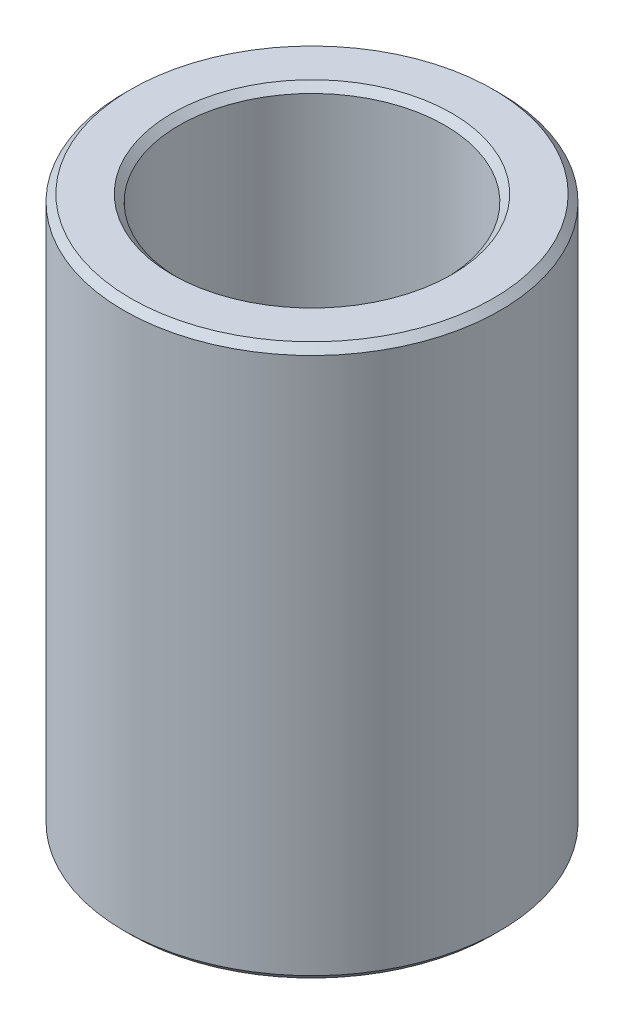
ISO-10303-21;
HEADER;
FILE_DESCRIPTION(('STEP AP214'),'2;1');
FILE_NAME('part.step','',(''),(''),'','','');
FILE_SCHEMA(('AUTOMOTIVE_DESIGN { 1 0 10303 214 1 1 1 1 }'));
ENDSEC;
DATA;
#1=APPLICATION_CONTEXT('core data for automotive mechanical design processes');
#2=APPLICATION_PROTOCOL_DEFINITION('international standard','automotive_design',2000,#1);
#3=PRODUCT_CONTEXT('',#1,'mechanical');
#4=PRODUCT('Part','Part','',(#3));
#5=PRODUCT_RELATED_PRODUCT_CATEGORY('part','',(#4));
#6=PRODUCT_DEFINITION_FORMATION('','',#4);
#7=PRODUCT_DEFINITION_CONTEXT('part definition',#1,'design');
#8=PRODUCT_DEFINITION('design','',#6,#7);
#9=PRODUCT_DEFINITION_SHAPE('','',#8);
#10=(LENGTH_UNIT() NAMED_UNIT(*) SI_UNIT(.MILLI.,.METRE.));
#11=(NAMED_UNIT(*) PLANE_ANGLE_UNIT() SI_UNIT($,.RADIAN.));
#12=(NAMED_UNIT(*) SI_UNIT($,.STERADIAN.) SOLID_ANGLE_UNIT());
#13=UNCERTAINTY_MEASURE_WITH_UNIT(LENGTH_MEASURE(1.E-05),#10,'distance_accuracy_value','');
#14=(GEOMETRIC_REPRESENTATION_CONTEXT(3) GLOBAL_UNCERTAINTY_ASSIGNED_CONTEXT((#13)) GLOBAL_UNIT_ASSIGNED_CONTEXT((#10,
#11,#12)) REPRESENTATION_CONTEXT('',''));
#15=CARTESIAN_POINT('',(0.,0.,0.));
#16=DIRECTION('',(0.,0.,1.));
#17=DIRECTION('',(1.,0.,0.));
#18=AXIS2_PLACEMENT_3D('',#15,#16,#17);
#19=CARTESIAN_POINT('',(0.,139.138711341542,0.));
#20=DIRECTION('',(0.,-1.,0.));
#21=DIRECTION('',(0.,0.,-1.));
#22=AXIS2_PLACEMENT_3D('',#19,#20,#21);
#23=CYLINDRICAL_SURFACE('',#22,47.5);
#24=CARTESIAN_POINT('',(0.,1.75974914424126,0.));
#25=DIRECTION('',(0.,1.,0.));
#26=DIRECTION('',(0.,0.,1.));
#27=AXIS2_PLACEMENT_3D('',#24,#25,#26);
#28=CIRCLE('',#27,47.5);
#29=CARTESIAN_POINT('',(0.,1.75974914424126,47.5));
#30=VERTEX_POINT('',#29);
#31=EDGE_CURVE('E10',#30,#30,#28,.T.);
#32=ORIENTED_EDGE('',*,*,#31,.T.);
#33=EDGE_LOOP('',(#32));
#34=FACE_BOUND('',#33,.T.);
#35=CARTESIAN_POINT('',(0.,137.378962197301,0.));
#36=DIRECTION('',(0.,1.,0.));
#37=DIRECTION('',(0.,0.,1.));
#38=AXIS2_PLACEMENT_3D('',#35,#36,#37);
#39=CIRCLE('',#38,47.5);
#40=CARTESIAN_POINT('',(0.,137.378962197301,47.5));
#41=VERTEX_POINT('',#40);
#42=EDGE_CURVE('E50',#41,#41,#39,.F.);
#43=ORIENTED_EDGE('',*,*,#42,.T.);
#44=EDGE_LOOP('',(#43));
#45=FACE_BOUND('',#44,.T.);
#46=ADVANCED_FACE('F39',(#34,#45),#23,.T.);
#47=CARTESIAN_POINT('',(0.,139.138711341542,0.));
#48=DIRECTION('',(0.,1.,0.));
#49=DIRECTION('',(0.,0.,1.));
#50=AXIS2_PLACEMENT_3D('',#47,#48,#49);
#51=PLANE('',#50);
#52=CARTESIAN_POINT('',(0.,139.138711341542,0.));
#53=DIRECTION('',(0.,1.,0.));
#54=DIRECTION('',(0.,0.,1.));
#55=AXIS2_PLACEMENT_3D('',#52,#53,#54);
#56=CIRCLE('',#55,35.3098455021052);
#57=CARTESIAN_POINT('',(0.,139.138711341542,35.3098455021052));
#58=VERTEX_POINT('',#57);
#59=EDGE_CURVE('E58',#58,#58,#56,.F.);
#60=ORIENTED_EDGE('',*,*,#59,.T.);
#61=EDGE_LOOP('',(#60));
#62=FACE_BOUND('',#61,.T.);
#63=CARTESIAN_POINT('',(0.,139.138711341542,0.));
#64=DIRECTION('',(0.,1.,0.));
#65=DIRECTION('',(0.,0.,1.));
#66=AXIS2_PLACEMENT_3D('',#63,#64,#65);
#67=CIRCLE('',#66,45.7402508557588);
#68=CARTESIAN_POINT('',(0.,139.138711341542,45.7402508557588));
#69=VERTEX_POINT('',#68);
#70=EDGE_CURVE('E61',#69,#69,#67,.T.);
#71=ORIENTED_EDGE('',*,*,#70,.T.);
#72=EDGE_LOOP('',(#71));
#73=FACE_BOUND('',#72,.T.);
#74=ADVANCED_FACE('F88',(#62,#73),#51,.T.);
#75=CARTESIAN_POINT('',(0.,0.,0.));
#76=DIRECTION('',(0.,1.,0.));
#77=DIRECTION('',(0.,0.,1.));
#78=AXIS2_PLACEMENT_3D('',#75,#76,#77);
#79=PLANE('',#78);
#80=CARTESIAN_POINT('',(0.,0.,0.));
#81=DIRECTION('',(0.,1.,0.));
#82=DIRECTION('',(0.,0.,1.));
#83=AXIS2_PLACEMENT_3D('',#80,#81,#82);
#84=CIRCLE('',#83,35.3098455021052);
#85=CARTESIAN_POINT('',(0.,0.,35.3098455021052));
#86=VERTEX_POINT('',#85);
#87=EDGE_CURVE('E51',#86,#86,#84,.T.);
#88=ORIENTED_EDGE('',*,*,#87,.T.);
#89=EDGE_LOOP('',(#88));
#90=FACE_BOUND('',#89,.T.);
#91=CARTESIAN_POINT('',(0.,0.,0.));
#92=DIRECTION('',(0.,1.,0.));
#93=DIRECTION('',(0.,0.,1.));
#94=AXIS2_PLACEMENT_3D('',#91,#92,#93);
#95=CIRCLE('',#94,45.7402508557587);
#96=CARTESIAN_POINT('',(0.,0.,45.7402508557587));
#97=VERTEX_POINT('',#96);
#98=EDGE_CURVE('E54',#97,#97,#95,.F.);
#99=ORIENTED_EDGE('',*,*,#98,.T.);
#100=EDGE_LOOP('',(#99));
#101=FACE_BOUND('',#100,.T.);
#102=ADVANCED_FACE('F83',(#90,#101),#79,.F.);
#103=CARTESIAN_POINT('',(0.,139.138711341542,0.));
#104=DIRECTION('',(0.,-1.,0.));
#105=DIRECTION('',(0.,0.,-1.));
#106=AXIS2_PLACEMENT_3D('',#103,#104,#105);
#107=CYLINDRICAL_SURFACE('',#106,33.5500963578639);
#108=CARTESIAN_POINT('',(0.,137.378962197301,0.));
#109=DIRECTION('',(0.,1.,0.));
#110=DIRECTION('',(0.,0.,1.));
#111=AXIS2_PLACEMENT_3D('',#108,#109,#110);
#112=CIRCLE('',#111,33.5500963578639);
#113=CARTESIAN_POINT('',(0.,137.378962197301,33.5500963578639));
#114=VERTEX_POINT('',#113);
#115=EDGE_CURVE('E67',#114,#114,#112,.T.);
#116=ORIENTED_EDGE('',*,*,#115,.T.);
#117=EDGE_LOOP('',(#116));
#118=FACE_BOUND('',#117,.T.);
#119=CARTESIAN_POINT('',(0.,1.75974914424129,0.));
#120=DIRECTION('',(0.,1.,0.));
#121=DIRECTION('',(0.,0.,1.));
#122=AXIS2_PLACEMENT_3D('',#119,#120,#121);
#123=CIRCLE('',#122,33.5500963578639);
#124=CARTESIAN_POINT('',(0.,1.75974914424129,33.5500963578639));
#125=VERTEX_POINT('',#124);
#126=EDGE_CURVE('E69',#125,#125,#123,.F.);
#127=ORIENTED_EDGE('',*,*,#126,.T.);
#128=EDGE_LOOP('',(#127));
#129=FACE_BOUND('',#128,.T.);
#130=ADVANCED_FACE('F71',(#118,#129),#107,.F.);
#131=CARTESIAN_POINT('',(0.,137.378962197301,0.));
#132=DIRECTION('',(0.,1.,0.));
#133=DIRECTION('',(0.,0.,1.));
#134=AXIS2_PLACEMENT_3D('',#131,#132,#133);
#135=CONICAL_SURFACE('',#134,33.5500963578639,0.785398163397448);
#136=ORIENTED_EDGE('',*,*,#59,.F.);
#137=EDGE_LOOP('',(#136));
#138=FACE_BOUND('',#137,.T.);
#139=ORIENTED_EDGE('',*,*,#115,.F.);
#140=EDGE_LOOP('',(#139));
#141=FACE_BOUND('',#140,.T.);
#142=ADVANCED_FACE('F77',(#138,#141),#135,.F.);
#143=CARTESIAN_POINT('',(0.,0.,0.));
#144=DIRECTION('',(0.,-1.,0.));
#145=DIRECTION('',(0.,0.,-1.));
#146=AXIS2_PLACEMENT_3D('',#143,#144,#145);
#147=CONICAL_SURFACE('',#146,35.3098455021052,0.785398163397437);
#148=ORIENTED_EDGE('',*,*,#126,.F.);
#149=EDGE_LOOP('',(#148));
#150=FACE_BOUND('',#149,.T.);
#151=ORIENTED_EDGE('',*,*,#87,.F.);
#152=EDGE_LOOP('',(#151));
#153=FACE_BOUND('',#152,.T.);
#154=ADVANCED_FACE('F73',(#150,#153),#147,.F.);
#155=CARTESIAN_POINT('',(0.,1.75974914424126,0.));
#156=DIRECTION('',(0.,1.,0.));
#157=DIRECTION('',(0.,0.,1.));
#158=AXIS2_PLACEMENT_3D('',#155,#156,#157);
#159=CONICAL_SURFACE('',#158,47.5,0.785398163397454);
#160=ORIENTED_EDGE('',*,*,#98,.F.);
#161=EDGE_LOOP('',(#160));
#162=FACE_BOUND('',#161,.T.);
#163=ORIENTED_EDGE('',*,*,#31,.F.);
#164=EDGE_LOOP('',(#163));
#165=FACE_BOUND('',#164,.T.);
#166=ADVANCED_FACE('F76',(#162,#165),#159,.T.);
#167=CARTESIAN_POINT('',(0.,139.138711341542,0.));
#168=DIRECTION('',(0.,-1.,0.));
#169=DIRECTION('',(0.,0.,-1.));
#170=AXIS2_PLACEMENT_3D('',#167,#168,#169);
#171=CONICAL_SURFACE('',#170,45.7402508557588,0.78539816339744);
#172=ORIENTED_EDGE('',*,*,#42,.F.);
#173=EDGE_LOOP('',(#172));
#174=FACE_BOUND('',#173,.T.);
#175=ORIENTED_EDGE('',*,*,#70,.F.);
#176=EDGE_LOOP('',(#175));
#177=FACE_BOUND('',#176,.T.);
#178=ADVANCED_FACE('F45',(#174,#177),#171,.T.);
#179=CLOSED_SHELL('',(#46,#74,#102,#130,#142,#154,#166,#178));
#180=MANIFOLD_SOLID_BREP('B2',#179);
#181=ADVANCED_BREP_SHAPE_REPRESENTATION('',(#18,#180),#14);
#182=SHAPE_DEFINITION_REPRESENTATION(#9,#181);
ENDSEC;
END-ISO-10303-21;
